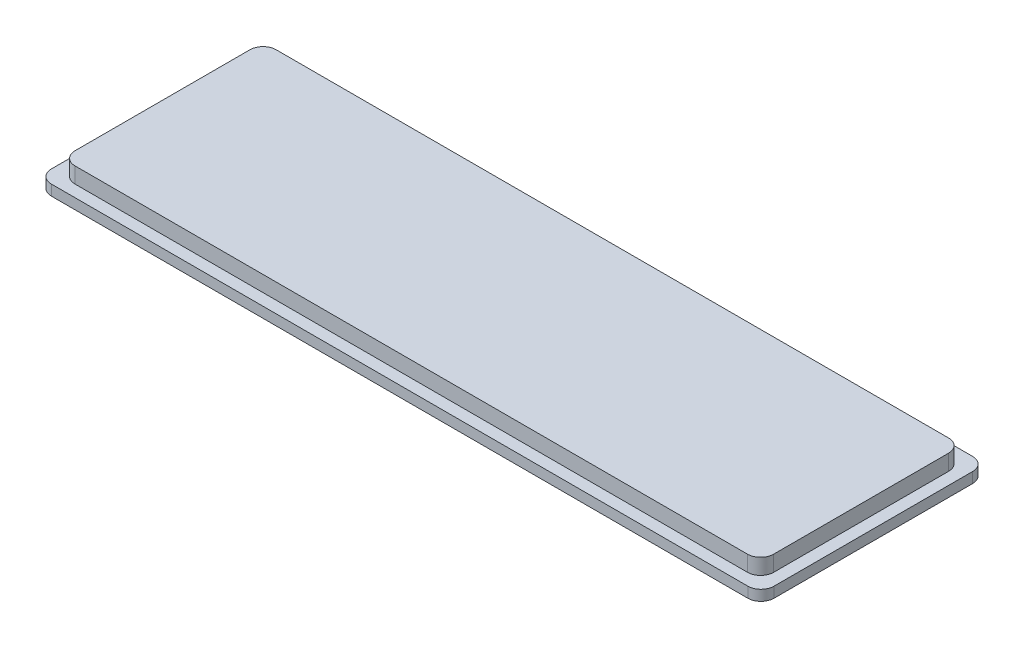
ISO-10303-21;
HEADER;
FILE_DESCRIPTION(('STEP AP214'),'2;1');
FILE_NAME('part.step','',(''),(''),'','','');
FILE_SCHEMA(('AUTOMOTIVE_DESIGN { 1 0 10303 214 1 1 1 1 }'));
ENDSEC;
DATA;
#1=APPLICATION_CONTEXT('core data for automotive mechanical design processes');
#2=APPLICATION_PROTOCOL_DEFINITION('international standard','automotive_design',2000,#1);
#3=PRODUCT_CONTEXT('',#1,'mechanical');
#4=PRODUCT('Part','Part','',(#3));
#5=PRODUCT_RELATED_PRODUCT_CATEGORY('part','',(#4));
#6=PRODUCT_DEFINITION_FORMATION('','',#4);
#7=PRODUCT_DEFINITION_CONTEXT('part definition',#1,'design');
#8=PRODUCT_DEFINITION('design','',#6,#7);
#9=PRODUCT_DEFINITION_SHAPE('','',#8);
#10=(LENGTH_UNIT() NAMED_UNIT(*) SI_UNIT(.MILLI.,.METRE.));
#11=(NAMED_UNIT(*) PLANE_ANGLE_UNIT() SI_UNIT($,.RADIAN.));
#12=(NAMED_UNIT(*) SI_UNIT($,.STERADIAN.) SOLID_ANGLE_UNIT());
#13=UNCERTAINTY_MEASURE_WITH_UNIT(LENGTH_MEASURE(1.E-05),#10,'distance_accuracy_value','');
#14=(GEOMETRIC_REPRESENTATION_CONTEXT(3) GLOBAL_UNCERTAINTY_ASSIGNED_CONTEXT((#13)) GLOBAL_UNIT_ASSIGNED_CONTEXT((#10,
#11,#12)) REPRESENTATION_CONTEXT('',''));
#15=CARTESIAN_POINT('',(0.,0.,0.));
#16=DIRECTION('',(0.,0.,1.));
#17=DIRECTION('',(1.,0.,0.));
#18=AXIS2_PLACEMENT_3D('',#15,#16,#17);
#19=CARTESIAN_POINT('',(0.,1.016,0.));
#20=DIRECTION('',(0.,-1.,0.));
#21=DIRECTION('',(0.,0.,-1.));
#22=AXIS2_PLACEMENT_3D('',#19,#20,#21);
#23=PLANE('',#22);
#24=DIRECTION('',(-1.,0.,0.));
#25=VECTOR('',#24,1.);
#26=CARTESIAN_POINT('',(0.,1.016,-21.7678));
#27=LINE('',#26,#25);
#28=CARTESIAN_POINT('',(68.71716,1.016,-21.7678));
#29=VERTEX_POINT('',#28);
#30=CARTESIAN_POINT('',(1.27,1.016,-21.7678));
#31=VERTEX_POINT('',#30);
#32=EDGE_CURVE('E186',#29,#31,#27,.T.);
#33=ORIENTED_EDGE('',*,*,#32,.T.);
#34=CARTESIAN_POINT('',(1.27,1.016,-20.4978));
#35=DIRECTION('',(0.,-1.,0.));
#36=DIRECTION('',(0.,0.,-1.));
#37=AXIS2_PLACEMENT_3D('',#34,#35,#36);
#38=CIRCLE('',#37,1.27);
#39=CARTESIAN_POINT('',(0.,1.016,-20.4978));
#40=VERTEX_POINT('',#39);
#41=EDGE_CURVE('E208',#31,#40,#38,.F.);
#42=ORIENTED_EDGE('',*,*,#41,.T.);
#43=DIRECTION('',(0.,0.,1.));
#44=VECTOR('',#43,1.);
#45=CARTESIAN_POINT('',(0.,1.016,0.));
#46=LINE('',#45,#44);
#47=CARTESIAN_POINT('',(0.,1.016,-1.27));
#48=VERTEX_POINT('',#47);
#49=EDGE_CURVE('E169',#40,#48,#46,.T.);
#50=ORIENTED_EDGE('',*,*,#49,.T.);
#51=CARTESIAN_POINT('',(1.27,1.016,-1.27));
#52=DIRECTION('',(0.,-1.,0.));
#53=DIRECTION('',(0.,0.,-1.));
#54=AXIS2_PLACEMENT_3D('',#51,#52,#53);
#55=CIRCLE('',#54,1.27);
#56=CARTESIAN_POINT('',(1.27,1.016,0.));
#57=VERTEX_POINT('',#56);
#58=EDGE_CURVE('E206',#48,#57,#55,.F.);
#59=ORIENTED_EDGE('',*,*,#58,.T.);
#60=DIRECTION('',(1.,0.,0.));
#61=VECTOR('',#60,1.);
#62=CARTESIAN_POINT('',(0.,1.016,0.));
#63=LINE('',#62,#61);
#64=CARTESIAN_POINT('',(68.71716,1.016,0.));
#65=VERTEX_POINT('',#64);
#66=EDGE_CURVE('E293',#57,#65,#63,.T.);
#67=ORIENTED_EDGE('',*,*,#66,.T.);
#68=CARTESIAN_POINT('',(68.71716,1.016,-1.27));
#69=DIRECTION('',(0.,-1.,0.));
#70=DIRECTION('',(0.,0.,-1.));
#71=AXIS2_PLACEMENT_3D('',#68,#69,#70);
#72=CIRCLE('',#71,1.27);
#73=CARTESIAN_POINT('',(69.98716,1.016,-1.27));
#74=VERTEX_POINT('',#73);
#75=EDGE_CURVE('E202',#65,#74,#72,.F.);
#76=ORIENTED_EDGE('',*,*,#75,.T.);
#77=DIRECTION('',(0.,0.,-1.));
#78=VECTOR('',#77,1.);
#79=CARTESIAN_POINT('',(69.98716,1.016,0.));
#80=LINE('',#79,#78);
#81=CARTESIAN_POINT('',(69.98716,1.016,-20.4978));
#82=VERTEX_POINT('',#81);
#83=EDGE_CURVE('E295',#74,#82,#80,.T.);
#84=ORIENTED_EDGE('',*,*,#83,.T.);
#85=CARTESIAN_POINT('',(68.71716,1.016,-20.4978));
#86=DIRECTION('',(0.,-1.,0.));
#87=DIRECTION('',(0.,0.,-1.));
#88=AXIS2_PLACEMENT_3D('',#85,#86,#87);
#89=CIRCLE('',#88,1.27);
#90=EDGE_CURVE('E204',#82,#29,#89,.F.);
#91=ORIENTED_EDGE('',*,*,#90,.T.);
#92=EDGE_LOOP('',(#33,#42,#50,#59,#67,#76,#84,#91));
#93=FACE_BOUND('',#92,.T.);
#94=DIRECTION('',(0.,0.,1.));
#95=VECTOR('',#94,1.);
#96=CARTESIAN_POINT('',(1.143,1.016,-1.143));
#97=LINE('',#96,#95);
#98=CARTESIAN_POINT('',(1.143,1.016,-19.3548));
#99=VERTEX_POINT('',#98);
#100=CARTESIAN_POINT('',(1.143,1.016,-2.413));
#101=VERTEX_POINT('',#100);
#102=EDGE_CURVE('E288',#99,#101,#97,.T.);
#103=ORIENTED_EDGE('',*,*,#102,.F.);
#104=CARTESIAN_POINT('',(2.413,1.016,-19.3548));
#105=DIRECTION('',(0.,-1.,0.));
#106=DIRECTION('',(0.,0.,-1.));
#107=AXIS2_PLACEMENT_3D('',#104,#105,#106);
#108=CIRCLE('',#107,1.27);
#109=CARTESIAN_POINT('',(2.413,1.016,-20.6248));
#110=VERTEX_POINT('',#109);
#111=EDGE_CURVE('E246',#99,#110,#108,.T.);
#112=ORIENTED_EDGE('',*,*,#111,.T.);
#113=DIRECTION('',(-1.,0.,0.));
#114=VECTOR('',#113,1.);
#115=CARTESIAN_POINT('',(1.143,1.016,-20.6248));
#116=LINE('',#115,#114);
#117=CARTESIAN_POINT('',(67.5386,1.016,-20.6248));
#118=VERTEX_POINT('',#117);
#119=EDGE_CURVE('E255',#118,#110,#116,.T.);
#120=ORIENTED_EDGE('',*,*,#119,.F.);
#121=CARTESIAN_POINT('',(67.5386,1.016,-19.3548));
#122=DIRECTION('',(0.,-1.,0.));
#123=DIRECTION('',(0.,0.,-1.));
#124=AXIS2_PLACEMENT_3D('',#121,#122,#123);
#125=CIRCLE('',#124,1.27);
#126=CARTESIAN_POINT('',(68.8086,1.016,-19.3548));
#127=VERTEX_POINT('',#126);
#128=EDGE_CURVE('E43',#118,#127,#125,.T.);
#129=ORIENTED_EDGE('',*,*,#128,.T.);
#130=DIRECTION('',(0.,0.,-1.));
#131=VECTOR('',#130,1.);
#132=CARTESIAN_POINT('',(68.8086,1.016,-1.143));
#133=LINE('',#132,#131);
#134=CARTESIAN_POINT('',(68.8086,1.016,-2.413));
#135=VERTEX_POINT('',#134);
#136=EDGE_CURVE('E253',#135,#127,#133,.T.);
#137=ORIENTED_EDGE('',*,*,#136,.F.);
#138=CARTESIAN_POINT('',(67.5386,1.016,-2.413));
#139=DIRECTION('',(0.,-1.,0.));
#140=DIRECTION('',(0.,0.,-1.));
#141=AXIS2_PLACEMENT_3D('',#138,#139,#140);
#142=CIRCLE('',#141,1.27);
#143=CARTESIAN_POINT('',(67.5386,1.016,-1.143));
#144=VERTEX_POINT('',#143);
#145=EDGE_CURVE('E11',#135,#144,#142,.T.);
#146=ORIENTED_EDGE('',*,*,#145,.T.);
#147=DIRECTION('',(1.,0.,0.));
#148=VECTOR('',#147,1.);
#149=CARTESIAN_POINT('',(1.143,1.016,-1.143));
#150=LINE('',#149,#148);
#151=CARTESIAN_POINT('',(2.413,1.016,-1.143));
#152=VERTEX_POINT('',#151);
#153=EDGE_CURVE('E260',#152,#144,#150,.T.);
#154=ORIENTED_EDGE('',*,*,#153,.F.);
#155=CARTESIAN_POINT('',(2.413,1.016,-2.413));
#156=DIRECTION('',(0.,-1.,0.));
#157=DIRECTION('',(0.,0.,-1.));
#158=AXIS2_PLACEMENT_3D('',#155,#156,#157);
#159=CIRCLE('',#158,1.27);
#160=EDGE_CURVE('E248',#152,#101,#159,.T.);
#161=ORIENTED_EDGE('',*,*,#160,.T.);
#162=EDGE_LOOP('',(#103,#112,#120,#129,#137,#146,#154,#161));
#163=FACE_BOUND('',#162,.T.);
#164=ADVANCED_FACE('F35',(#93,#163),#23,.F.);
#165=CARTESIAN_POINT('',(0.,1.016,0.));
#166=DIRECTION('',(1.,0.,0.));
#167=DIRECTION('',(0.,0.,-1.));
#168=AXIS2_PLACEMENT_3D('',#165,#166,#167);
#169=PLANE('',#168);
#170=ORIENTED_EDGE('',*,*,#49,.F.);
#171=DIRECTION('',(0.,-1.,0.));
#172=VECTOR('',#171,1.);
#173=CARTESIAN_POINT('',(0.,1.016,-20.4978));
#174=LINE('',#173,#172);
#175=CARTESIAN_POINT('',(0.,0.,-20.4978));
#176=VERTEX_POINT('',#175);
#177=EDGE_CURVE('E153',#40,#176,#174,.T.);
#178=ORIENTED_EDGE('',*,*,#177,.T.);
#179=DIRECTION('',(0.,0.,1.));
#180=VECTOR('',#179,1.);
#181=CARTESIAN_POINT('',(0.,0.,0.));
#182=LINE('',#181,#180);
#183=CARTESIAN_POINT('',(0.,0.,-1.27));
#184=VERTEX_POINT('',#183);
#185=EDGE_CURVE('E166',#176,#184,#182,.T.);
#186=ORIENTED_EDGE('',*,*,#185,.T.);
#187=DIRECTION('',(0.,-1.,0.));
#188=VECTOR('',#187,1.);
#189=CARTESIAN_POINT('',(0.,1.016,-1.27));
#190=LINE('',#189,#188);
#191=EDGE_CURVE('E171',#184,#48,#190,.F.);
#192=ORIENTED_EDGE('',*,*,#191,.T.);
#193=EDGE_LOOP('',(#170,#178,#186,#192));
#194=FACE_BOUND('',#193,.T.);
#195=ADVANCED_FACE('F165',(#194),#169,.F.);
#196=CARTESIAN_POINT('',(0.,1.016,0.));
#197=DIRECTION('',(0.,0.,-1.));
#198=DIRECTION('',(-1.,0.,0.));
#199=AXIS2_PLACEMENT_3D('',#196,#197,#198);
#200=PLANE('',#199);
#201=ORIENTED_EDGE('',*,*,#66,.F.);
#202=DIRECTION('',(0.,-1.,0.));
#203=VECTOR('',#202,1.);
#204=CARTESIAN_POINT('',(1.27,1.016,0.));
#205=LINE('',#204,#203);
#206=CARTESIAN_POINT('',(1.27,0.,0.));
#207=VERTEX_POINT('',#206);
#208=EDGE_CURVE('E229',#57,#207,#205,.T.);
#209=ORIENTED_EDGE('',*,*,#208,.T.);
#210=DIRECTION('',(1.,0.,0.));
#211=VECTOR('',#210,1.);
#212=CARTESIAN_POINT('',(0.,0.,0.));
#213=LINE('',#212,#211);
#214=CARTESIAN_POINT('',(68.71716,0.,0.));
#215=VERTEX_POINT('',#214);
#216=EDGE_CURVE('E175',#207,#215,#213,.T.);
#217=ORIENTED_EDGE('',*,*,#216,.T.);
#218=DIRECTION('',(0.,-1.,0.));
#219=VECTOR('',#218,1.);
#220=CARTESIAN_POINT('',(68.71716,1.016,0.));
#221=LINE('',#220,#219);
#222=EDGE_CURVE('E227',#215,#65,#221,.F.);
#223=ORIENTED_EDGE('',*,*,#222,.T.);
#224=EDGE_LOOP('',(#201,#209,#217,#223));
#225=FACE_BOUND('',#224,.T.);
#226=ADVANCED_FACE('F318',(#225),#200,.F.);
#227=CARTESIAN_POINT('',(69.98716,1.016,0.));
#228=DIRECTION('',(-1.,0.,0.));
#229=DIRECTION('',(0.,0.,1.));
#230=AXIS2_PLACEMENT_3D('',#227,#228,#229);
#231=PLANE('',#230);
#232=DIRECTION('',(0.,0.,-1.));
#233=VECTOR('',#232,1.);
#234=CARTESIAN_POINT('',(69.98716,0.,0.));
#235=LINE('',#234,#233);
#236=CARTESIAN_POINT('',(69.98716,0.,-1.27));
#237=VERTEX_POINT('',#236);
#238=CARTESIAN_POINT('',(69.98716,0.,-20.4978));
#239=VERTEX_POINT('',#238);
#240=EDGE_CURVE('E179',#237,#239,#235,.T.);
#241=ORIENTED_EDGE('',*,*,#240,.T.);
#242=DIRECTION('',(0.,-1.,0.));
#243=VECTOR('',#242,1.);
#244=CARTESIAN_POINT('',(69.98716,1.016,-20.4978));
#245=LINE('',#244,#243);
#246=EDGE_CURVE('E240',#239,#82,#245,.F.);
#247=ORIENTED_EDGE('',*,*,#246,.T.);
#248=ORIENTED_EDGE('',*,*,#83,.F.);
#249=DIRECTION('',(0.,-1.,0.));
#250=VECTOR('',#249,1.);
#251=CARTESIAN_POINT('',(69.98716,1.016,-1.27));
#252=LINE('',#251,#250);
#253=EDGE_CURVE('E237',#74,#237,#252,.T.);
#254=ORIENTED_EDGE('',*,*,#253,.T.);
#255=EDGE_LOOP('',(#241,#247,#248,#254));
#256=FACE_BOUND('',#255,.T.);
#257=ADVANCED_FACE('F311',(#256),#231,.F.);
#258=CARTESIAN_POINT('',(0.,1.016,-21.7678));
#259=DIRECTION('',(0.,0.,1.));
#260=DIRECTION('',(1.,0.,0.));
#261=AXIS2_PLACEMENT_3D('',#258,#259,#260);
#262=PLANE('',#261);
#263=DIRECTION('',(-1.,0.,0.));
#264=VECTOR('',#263,1.);
#265=CARTESIAN_POINT('',(0.,0.,-21.7678));
#266=LINE('',#265,#264);
#267=CARTESIAN_POINT('',(68.71716,0.,-21.7678));
#268=VERTEX_POINT('',#267);
#269=CARTESIAN_POINT('',(1.27,0.,-21.7678));
#270=VERTEX_POINT('',#269);
#271=EDGE_CURVE('E191',#268,#270,#266,.T.);
#272=ORIENTED_EDGE('',*,*,#271,.T.);
#273=DIRECTION('',(0.,-1.,0.));
#274=VECTOR('',#273,1.);
#275=CARTESIAN_POINT('',(1.27,1.016,-21.7678));
#276=LINE('',#275,#274);
#277=EDGE_CURVE('E154',#270,#31,#276,.F.);
#278=ORIENTED_EDGE('',*,*,#277,.T.);
#279=ORIENTED_EDGE('',*,*,#32,.F.);
#280=DIRECTION('',(0.,-1.,0.));
#281=VECTOR('',#280,1.);
#282=CARTESIAN_POINT('',(68.71716,1.016,-21.7678));
#283=LINE('',#282,#281);
#284=EDGE_CURVE('E159',#29,#268,#283,.T.);
#285=ORIENTED_EDGE('',*,*,#284,.T.);
#286=EDGE_LOOP('',(#272,#278,#279,#285));
#287=FACE_BOUND('',#286,.T.);
#288=ADVANCED_FACE('F305',(#287),#262,.F.);
#289=CARTESIAN_POINT('',(0.,0.,0.));
#290=DIRECTION('',(0.,-1.,0.));
#291=DIRECTION('',(0.,0.,-1.));
#292=AXIS2_PLACEMENT_3D('',#289,#290,#291);
#293=PLANE('',#292);
#294=ORIENTED_EDGE('',*,*,#185,.F.);
#295=CARTESIAN_POINT('',(1.27,0.,-20.4978));
#296=DIRECTION('',(0.,-1.,0.));
#297=DIRECTION('',(0.,0.,-1.));
#298=AXIS2_PLACEMENT_3D('',#295,#296,#297);
#299=CIRCLE('',#298,1.27);
#300=EDGE_CURVE('E149',#176,#270,#299,.T.);
#301=ORIENTED_EDGE('',*,*,#300,.T.);
#302=ORIENTED_EDGE('',*,*,#271,.F.);
#303=CARTESIAN_POINT('',(68.71716,0.,-20.4978));
#304=DIRECTION('',(0.,-1.,0.));
#305=DIRECTION('',(0.,0.,-1.));
#306=AXIS2_PLACEMENT_3D('',#303,#304,#305);
#307=CIRCLE('',#306,1.27);
#308=EDGE_CURVE('E196',#268,#239,#307,.T.);
#309=ORIENTED_EDGE('',*,*,#308,.T.);
#310=ORIENTED_EDGE('',*,*,#240,.F.);
#311=CARTESIAN_POINT('',(68.71716,0.,-1.27));
#312=DIRECTION('',(0.,-1.,0.));
#313=DIRECTION('',(0.,0.,-1.));
#314=AXIS2_PLACEMENT_3D('',#311,#312,#313);
#315=CIRCLE('',#314,1.27);
#316=EDGE_CURVE('E170',#237,#215,#315,.T.);
#317=ORIENTED_EDGE('',*,*,#316,.T.);
#318=ORIENTED_EDGE('',*,*,#216,.F.);
#319=CARTESIAN_POINT('',(1.27,0.,-1.27));
#320=DIRECTION('',(0.,-1.,0.));
#321=DIRECTION('',(0.,0.,-1.));
#322=AXIS2_PLACEMENT_3D('',#319,#320,#321);
#323=CIRCLE('',#322,1.27);
#324=EDGE_CURVE('E160',#207,#184,#323,.T.);
#325=ORIENTED_EDGE('',*,*,#324,.T.);
#326=EDGE_LOOP('',(#294,#301,#302,#309,#310,#317,#318,#325));
#327=FACE_BOUND('',#326,.T.);
#328=ADVANCED_FACE('F173',(#327),#293,.T.);
#329=CARTESIAN_POINT('',(1.143,2.54,-1.143));
#330=DIRECTION('',(1.,0.,0.));
#331=DIRECTION('',(0.,0.,-1.));
#332=AXIS2_PLACEMENT_3D('',#329,#330,#331);
#333=PLANE('',#332);
#334=DIRECTION('',(0.,0.,1.));
#335=VECTOR('',#334,1.);
#336=CARTESIAN_POINT('',(1.143,2.54,-1.143));
#337=LINE('',#336,#335);
#338=CARTESIAN_POINT('',(1.143,2.54,-19.3548));
#339=VERTEX_POINT('',#338);
#340=CARTESIAN_POINT('',(1.143,2.54,-2.413));
#341=VERTEX_POINT('',#340);
#342=EDGE_CURVE('E275',#339,#341,#337,.T.);
#343=ORIENTED_EDGE('',*,*,#342,.F.);
#344=DIRECTION('',(0.,-1.,0.));
#345=VECTOR('',#344,1.);
#346=CARTESIAN_POINT('',(1.143,2.54,-19.3548));
#347=LINE('',#346,#345);
#348=EDGE_CURVE('E212',#339,#99,#347,.T.);
#349=ORIENTED_EDGE('',*,*,#348,.T.);
#350=ORIENTED_EDGE('',*,*,#102,.T.);
#351=DIRECTION('',(0.,-1.,0.));
#352=VECTOR('',#351,1.);
#353=CARTESIAN_POINT('',(1.143,2.54,-2.413));
#354=LINE('',#353,#352);
#355=EDGE_CURVE('E210',#101,#341,#354,.F.);
#356=ORIENTED_EDGE('',*,*,#355,.T.);
#357=EDGE_LOOP('',(#343,#349,#350,#356));
#358=FACE_BOUND('',#357,.T.);
#359=ADVANCED_FACE('F278',(#358),#333,.F.);
#360=CARTESIAN_POINT('',(1.143,2.54,-1.143));
#361=DIRECTION('',(0.,0.,-1.));
#362=DIRECTION('',(-1.,0.,0.));
#363=AXIS2_PLACEMENT_3D('',#360,#361,#362);
#364=PLANE('',#363);
#365=DIRECTION('',(1.,0.,0.));
#366=VECTOR('',#365,1.);
#367=CARTESIAN_POINT('',(1.143,2.54,-1.143));
#368=LINE('',#367,#366);
#369=CARTESIAN_POINT('',(2.413,2.54,-1.143));
#370=VERTEX_POINT('',#369);
#371=CARTESIAN_POINT('',(67.5386,2.54,-1.143));
#372=VERTEX_POINT('',#371);
#373=EDGE_CURVE('E281',#370,#372,#368,.T.);
#374=ORIENTED_EDGE('',*,*,#373,.F.);
#375=DIRECTION('',(0.,-1.,0.));
#376=VECTOR('',#375,1.);
#377=CARTESIAN_POINT('',(2.413,2.54,-1.143));
#378=LINE('',#377,#376);
#379=EDGE_CURVE('E234',#370,#152,#378,.T.);
#380=ORIENTED_EDGE('',*,*,#379,.T.);
#381=ORIENTED_EDGE('',*,*,#153,.T.);
#382=DIRECTION('',(0.,-1.,0.));
#383=VECTOR('',#382,1.);
#384=CARTESIAN_POINT('',(67.5386,2.54,-1.143));
#385=LINE('',#384,#383);
#386=EDGE_CURVE('E232',#144,#372,#385,.F.);
#387=ORIENTED_EDGE('',*,*,#386,.T.);
#388=EDGE_LOOP('',(#374,#380,#381,#387));
#389=FACE_BOUND('',#388,.T.);
#390=ADVANCED_FACE('F361',(#389),#364,.F.);
#391=CARTESIAN_POINT('',(68.8086,2.54,-1.143));
#392=DIRECTION('',(-1.,0.,0.));
#393=DIRECTION('',(0.,0.,1.));
#394=AXIS2_PLACEMENT_3D('',#391,#392,#393);
#395=PLANE('',#394);
#396=ORIENTED_EDGE('',*,*,#136,.T.);
#397=DIRECTION('',(0.,-1.,0.));
#398=VECTOR('',#397,1.);
#399=CARTESIAN_POINT('',(68.8086,2.54,-19.3548));
#400=LINE('',#399,#398);
#401=CARTESIAN_POINT('',(68.8086,2.54,-19.3548));
#402=VERTEX_POINT('',#401);
#403=EDGE_CURVE('E50',#127,#402,#400,.F.);
#404=ORIENTED_EDGE('',*,*,#403,.T.);
#405=DIRECTION('',(0.,0.,-1.));
#406=VECTOR('',#405,1.);
#407=CARTESIAN_POINT('',(68.8086,2.54,-1.143));
#408=LINE('',#407,#406);
#409=CARTESIAN_POINT('',(68.8086,2.54,-2.413));
#410=VERTEX_POINT('',#409);
#411=EDGE_CURVE('E183',#410,#402,#408,.T.);
#412=ORIENTED_EDGE('',*,*,#411,.F.);
#413=DIRECTION('',(0.,-1.,0.));
#414=VECTOR('',#413,1.);
#415=CARTESIAN_POINT('',(68.8086,2.54,-2.413));
#416=LINE('',#415,#414);
#417=EDGE_CURVE('E242',#410,#135,#416,.T.);
#418=ORIENTED_EDGE('',*,*,#417,.T.);
#419=EDGE_LOOP('',(#396,#404,#412,#418));
#420=FACE_BOUND('',#419,.T.);
#421=ADVANCED_FACE('F258',(#420),#395,.F.);
#422=CARTESIAN_POINT('',(1.143,2.54,-20.6248));
#423=DIRECTION('',(0.,0.,1.));
#424=DIRECTION('',(1.,0.,0.));
#425=AXIS2_PLACEMENT_3D('',#422,#423,#424);
#426=PLANE('',#425);
#427=ORIENTED_EDGE('',*,*,#119,.T.);
#428=DIRECTION('',(0.,-1.,0.));
#429=VECTOR('',#428,1.);
#430=CARTESIAN_POINT('',(2.413,2.54,-20.6248));
#431=LINE('',#430,#429);
#432=CARTESIAN_POINT('',(2.413,2.54,-20.6248));
#433=VERTEX_POINT('',#432);
#434=EDGE_CURVE('E218',#110,#433,#431,.F.);
#435=ORIENTED_EDGE('',*,*,#434,.T.);
#436=DIRECTION('',(-1.,0.,0.));
#437=VECTOR('',#436,1.);
#438=CARTESIAN_POINT('',(1.143,2.54,-20.6248));
#439=LINE('',#438,#437);
#440=CARTESIAN_POINT('',(67.5386,2.54,-20.6248));
#441=VERTEX_POINT('',#440);
#442=EDGE_CURVE('E176',#441,#433,#439,.T.);
#443=ORIENTED_EDGE('',*,*,#442,.F.);
#444=DIRECTION('',(0.,-1.,0.));
#445=VECTOR('',#444,1.);
#446=CARTESIAN_POINT('',(67.5386,2.54,-20.6248));
#447=LINE('',#446,#445);
#448=EDGE_CURVE('E215',#441,#118,#447,.T.);
#449=ORIENTED_EDGE('',*,*,#448,.T.);
#450=EDGE_LOOP('',(#427,#435,#443,#449));
#451=FACE_BOUND('',#450,.T.);
#452=ADVANCED_FACE('F268',(#451),#426,.F.);
#453=CARTESIAN_POINT('',(0.,2.54,0.));
#454=DIRECTION('',(0.,-1.,0.));
#455=DIRECTION('',(0.,0.,-1.));
#456=AXIS2_PLACEMENT_3D('',#453,#454,#455);
#457=PLANE('',#456);
#458=ORIENTED_EDGE('',*,*,#442,.T.);
#459=CARTESIAN_POINT('',(2.413,2.54,-19.3548));
#460=DIRECTION('',(0.,-1.,0.));
#461=DIRECTION('',(0.,0.,-1.));
#462=AXIS2_PLACEMENT_3D('',#459,#460,#461);
#463=CIRCLE('',#462,1.27);
#464=EDGE_CURVE('E225',#433,#339,#463,.F.);
#465=ORIENTED_EDGE('',*,*,#464,.T.);
#466=ORIENTED_EDGE('',*,*,#342,.T.);
#467=CARTESIAN_POINT('',(2.413,2.54,-2.413));
#468=DIRECTION('',(0.,-1.,0.));
#469=DIRECTION('',(0.,0.,-1.));
#470=AXIS2_PLACEMENT_3D('',#467,#468,#469);
#471=CIRCLE('',#470,1.27);
#472=EDGE_CURVE('E223',#341,#370,#471,.F.);
#473=ORIENTED_EDGE('',*,*,#472,.T.);
#474=ORIENTED_EDGE('',*,*,#373,.T.);
#475=CARTESIAN_POINT('',(67.5386,2.54,-2.413));
#476=DIRECTION('',(0.,-1.,0.));
#477=DIRECTION('',(0.,0.,-1.));
#478=AXIS2_PLACEMENT_3D('',#475,#476,#477);
#479=CIRCLE('',#478,1.27);
#480=EDGE_CURVE('E57',#372,#410,#479,.F.);
#481=ORIENTED_EDGE('',*,*,#480,.T.);
#482=ORIENTED_EDGE('',*,*,#411,.T.);
#483=CARTESIAN_POINT('',(67.5386,2.54,-19.3548));
#484=DIRECTION('',(0.,-1.,0.));
#485=DIRECTION('',(0.,0.,-1.));
#486=AXIS2_PLACEMENT_3D('',#483,#484,#485);
#487=CIRCLE('',#486,1.27);
#488=EDGE_CURVE('E221',#402,#441,#487,.F.);
#489=ORIENTED_EDGE('',*,*,#488,.T.);
#490=EDGE_LOOP('',(#458,#465,#466,#473,#474,#481,#482,#489));
#491=FACE_BOUND('',#490,.T.);
#492=ADVANCED_FACE('F265',(#491),#457,.F.);
#493=CARTESIAN_POINT('',(1.27,1.016,-20.4978));
#494=DIRECTION('',(0.,-1.,0.));
#495=DIRECTION('',(0.,0.,-1.));
#496=AXIS2_PLACEMENT_3D('',#493,#494,#495);
#497=CYLINDRICAL_SURFACE('',#496,1.27);
#498=ORIENTED_EDGE('',*,*,#41,.F.);
#499=ORIENTED_EDGE('',*,*,#277,.F.);
#500=ORIENTED_EDGE('',*,*,#300,.F.);
#501=ORIENTED_EDGE('',*,*,#177,.F.);
#502=EDGE_LOOP('',(#498,#499,#500,#501));
#503=FACE_BOUND('',#502,.T.);
#504=ADVANCED_FACE('F152',(#503),#497,.T.);
#505=CARTESIAN_POINT('',(2.413,2.54,-19.3548));
#506=DIRECTION('',(0.,-1.,0.));
#507=DIRECTION('',(0.,0.,-1.));
#508=AXIS2_PLACEMENT_3D('',#505,#506,#507);
#509=CYLINDRICAL_SURFACE('',#508,1.27);
#510=ORIENTED_EDGE('',*,*,#464,.F.);
#511=ORIENTED_EDGE('',*,*,#434,.F.);
#512=ORIENTED_EDGE('',*,*,#111,.F.);
#513=ORIENTED_EDGE('',*,*,#348,.F.);
#514=EDGE_LOOP('',(#510,#511,#512,#513));
#515=FACE_BOUND('',#514,.T.);
#516=ADVANCED_FACE('F271',(#515),#509,.T.);
#517=CARTESIAN_POINT('',(1.27,1.016,-1.27));
#518=DIRECTION('',(0.,-1.,0.));
#519=DIRECTION('',(0.,0.,-1.));
#520=AXIS2_PLACEMENT_3D('',#517,#518,#519);
#521=CYLINDRICAL_SURFACE('',#520,1.27);
#522=ORIENTED_EDGE('',*,*,#58,.F.);
#523=ORIENTED_EDGE('',*,*,#191,.F.);
#524=ORIENTED_EDGE('',*,*,#324,.F.);
#525=ORIENTED_EDGE('',*,*,#208,.F.);
#526=EDGE_LOOP('',(#522,#523,#524,#525));
#527=FACE_BOUND('',#526,.T.);
#528=ADVANCED_FACE('F322',(#527),#521,.T.);
#529=CARTESIAN_POINT('',(2.413,2.54,-2.413));
#530=DIRECTION('',(0.,-1.,0.));
#531=DIRECTION('',(0.,0.,-1.));
#532=AXIS2_PLACEMENT_3D('',#529,#530,#531);
#533=CYLINDRICAL_SURFACE('',#532,1.27);
#534=ORIENTED_EDGE('',*,*,#472,.F.);
#535=ORIENTED_EDGE('',*,*,#355,.F.);
#536=ORIENTED_EDGE('',*,*,#160,.F.);
#537=ORIENTED_EDGE('',*,*,#379,.F.);
#538=EDGE_LOOP('',(#534,#535,#536,#537));
#539=FACE_BOUND('',#538,.T.);
#540=ADVANCED_FACE('F324',(#539),#533,.T.);
#541=CARTESIAN_POINT('',(68.71716,1.016,-20.4978));
#542=DIRECTION('',(0.,-1.,0.));
#543=DIRECTION('',(0.,0.,-1.));
#544=AXIS2_PLACEMENT_3D('',#541,#542,#543);
#545=CYLINDRICAL_SURFACE('',#544,1.27);
#546=ORIENTED_EDGE('',*,*,#90,.F.);
#547=ORIENTED_EDGE('',*,*,#246,.F.);
#548=ORIENTED_EDGE('',*,*,#308,.F.);
#549=ORIENTED_EDGE('',*,*,#284,.F.);
#550=EDGE_LOOP('',(#546,#547,#548,#549));
#551=FACE_BOUND('',#550,.T.);
#552=ADVANCED_FACE('F307',(#551),#545,.T.);
#553=CARTESIAN_POINT('',(67.5386,2.54,-19.3548));
#554=DIRECTION('',(0.,-1.,0.));
#555=DIRECTION('',(0.,0.,-1.));
#556=AXIS2_PLACEMENT_3D('',#553,#554,#555);
#557=CYLINDRICAL_SURFACE('',#556,1.27);
#558=ORIENTED_EDGE('',*,*,#488,.F.);
#559=ORIENTED_EDGE('',*,*,#403,.F.);
#560=ORIENTED_EDGE('',*,*,#128,.F.);
#561=ORIENTED_EDGE('',*,*,#448,.F.);
#562=EDGE_LOOP('',(#558,#559,#560,#561));
#563=FACE_BOUND('',#562,.T.);
#564=ADVANCED_FACE('F263',(#563),#557,.T.);
#565=CARTESIAN_POINT('',(67.5386,2.54,-2.413));
#566=DIRECTION('',(0.,-1.,0.));
#567=DIRECTION('',(0.,0.,-1.));
#568=AXIS2_PLACEMENT_3D('',#565,#566,#567);
#569=CYLINDRICAL_SURFACE('',#568,1.27);
#570=ORIENTED_EDGE('',*,*,#480,.F.);
#571=ORIENTED_EDGE('',*,*,#386,.F.);
#572=ORIENTED_EDGE('',*,*,#145,.F.);
#573=ORIENTED_EDGE('',*,*,#417,.F.);
#574=EDGE_LOOP('',(#570,#571,#572,#573));
#575=FACE_BOUND('',#574,.T.);
#576=ADVANCED_FACE('F372',(#575),#569,.T.);
#577=CARTESIAN_POINT('',(68.71716,1.016,-1.27));
#578=DIRECTION('',(0.,-1.,0.));
#579=DIRECTION('',(0.,0.,-1.));
#580=AXIS2_PLACEMENT_3D('',#577,#578,#579);
#581=CYLINDRICAL_SURFACE('',#580,1.27);
#582=ORIENTED_EDGE('',*,*,#75,.F.);
#583=ORIENTED_EDGE('',*,*,#222,.F.);
#584=ORIENTED_EDGE('',*,*,#316,.F.);
#585=ORIENTED_EDGE('',*,*,#253,.F.);
#586=EDGE_LOOP('',(#582,#583,#584,#585));
#587=FACE_BOUND('',#586,.T.);
#588=ADVANCED_FACE('F37',(#587),#581,.T.);
#589=CLOSED_SHELL('',(#164,#195,#226,#257,#288,#328,#359,#390,#421,#452,#492,#504,#516,#528,
#540,#552,#564,#576,#588));
#590=MANIFOLD_SOLID_BREP('B2',#589);
#591=ADVANCED_BREP_SHAPE_REPRESENTATION('',(#18,#590),#14);
#592=SHAPE_DEFINITION_REPRESENTATION(#9,#591);
ENDSEC;
END-ISO-10303-21;
